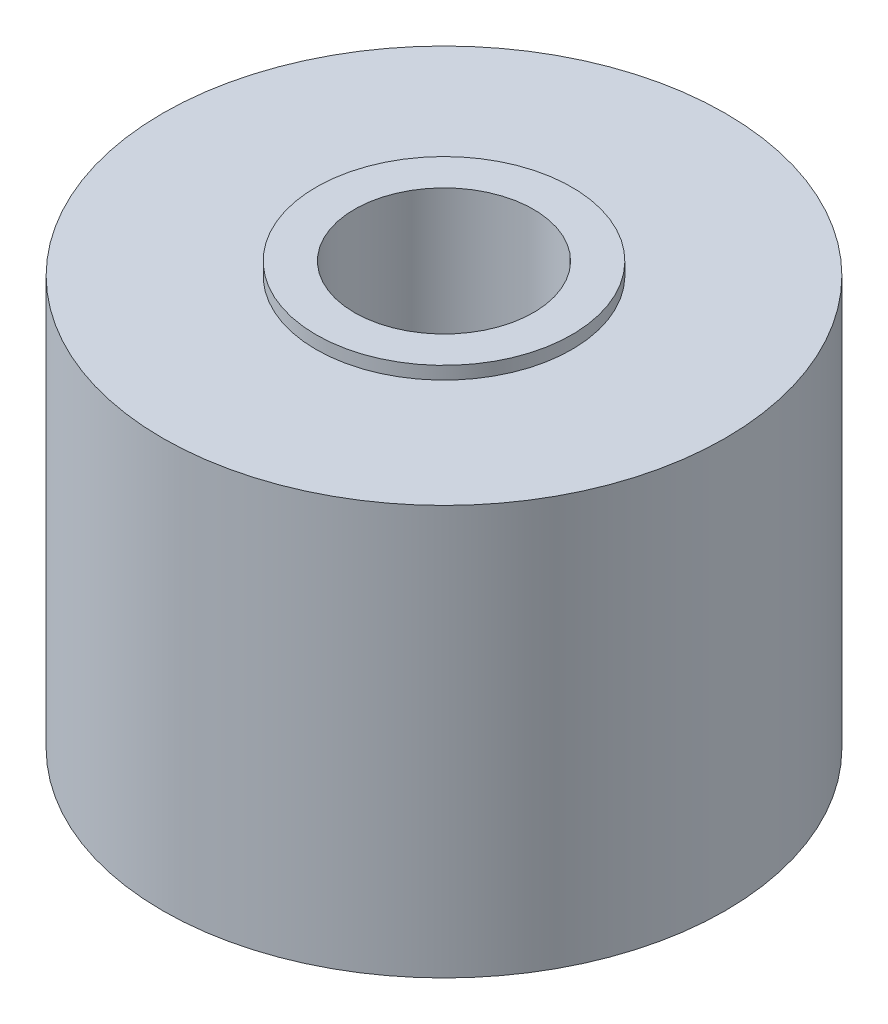
ISO-10303-21;
HEADER;
FILE_DESCRIPTION(('STEP AP214'),'2;1');
FILE_NAME('part.step','',(''),(''),'','','');
FILE_SCHEMA(('AUTOMOTIVE_DESIGN { 1 0 10303 214 1 1 1 1 }'));
ENDSEC;
DATA;
#1=APPLICATION_CONTEXT('core data for automotive mechanical design processes');
#2=APPLICATION_PROTOCOL_DEFINITION('international standard','automotive_design',2000,#1);
#3=PRODUCT_CONTEXT('',#1,'mechanical');
#4=PRODUCT('Part','Part','',(#3));
#5=PRODUCT_RELATED_PRODUCT_CATEGORY('part','',(#4));
#6=PRODUCT_DEFINITION_FORMATION('','',#4);
#7=PRODUCT_DEFINITION_CONTEXT('part definition',#1,'design');
#8=PRODUCT_DEFINITION('design','',#6,#7);
#9=PRODUCT_DEFINITION_SHAPE('','',#8);
#10=(LENGTH_UNIT() NAMED_UNIT(*) SI_UNIT(.MILLI.,.METRE.));
#11=(NAMED_UNIT(*) PLANE_ANGLE_UNIT() SI_UNIT($,.RADIAN.));
#12=(NAMED_UNIT(*) SI_UNIT($,.STERADIAN.) SOLID_ANGLE_UNIT());
#13=UNCERTAINTY_MEASURE_WITH_UNIT(LENGTH_MEASURE(1.E-05),#10,'distance_accuracy_value','');
#14=(GEOMETRIC_REPRESENTATION_CONTEXT(3) GLOBAL_UNCERTAINTY_ASSIGNED_CONTEXT((#13)) GLOBAL_UNIT_ASSIGNED_CONTEXT((#10,
#11,#12)) REPRESENTATION_CONTEXT('',''));
#15=CARTESIAN_POINT('',(0.,0.,0.));
#16=DIRECTION('',(0.,0.,1.));
#17=DIRECTION('',(1.,0.,0.));
#18=AXIS2_PLACEMENT_3D('',#15,#16,#17);
#19=CARTESIAN_POINT('',(0.,16.,0.));
#20=DIRECTION('',(0.,-1.,0.));
#21=DIRECTION('',(0.,0.,-1.));
#22=AXIS2_PLACEMENT_3D('',#19,#20,#21);
#23=CYLINDRICAL_SURFACE('',#22,11.);
#24=CARTESIAN_POINT('',(0.,16.,0.));
#25=DIRECTION('',(0.,1.,0.));
#26=DIRECTION('',(0.,0.,1.));
#27=AXIS2_PLACEMENT_3D('',#24,#25,#26);
#28=CIRCLE('',#27,11.);
#29=CARTESIAN_POINT('',(0.,16.,11.));
#30=VERTEX_POINT('',#29);
#31=EDGE_CURVE('E42',#30,#30,#28,.T.);
#32=ORIENTED_EDGE('',*,*,#31,.F.);
#33=EDGE_LOOP('',(#32));
#34=FACE_BOUND('',#33,.T.);
#35=CARTESIAN_POINT('',(0.,0.,0.));
#36=DIRECTION('',(0.,1.,0.));
#37=DIRECTION('',(0.,0.,1.));
#38=AXIS2_PLACEMENT_3D('',#35,#36,#37);
#39=CIRCLE('',#38,11.);
#40=CARTESIAN_POINT('',(0.,0.,11.));
#41=VERTEX_POINT('',#40);
#42=EDGE_CURVE('E33',#41,#41,#39,.T.);
#43=ORIENTED_EDGE('',*,*,#42,.T.);
#44=EDGE_LOOP('',(#43));
#45=FACE_BOUND('',#44,.T.);
#46=ADVANCED_FACE('F30',(#34,#45),#23,.T.);
#47=CARTESIAN_POINT('',(0.,16.,0.));
#48=DIRECTION('',(0.,1.,0.));
#49=DIRECTION('',(0.,0.,1.));
#50=AXIS2_PLACEMENT_3D('',#47,#48,#49);
#51=PLANE('',#50);
#52=CARTESIAN_POINT('',(0.,16.,0.));
#53=DIRECTION('',(0.,1.,0.));
#54=DIRECTION('',(0.,0.,1.));
#55=AXIS2_PLACEMENT_3D('',#52,#53,#54);
#56=CIRCLE('',#55,5.);
#57=CARTESIAN_POINT('',(0.,16.,5.));
#58=VERTEX_POINT('',#57);
#59=EDGE_CURVE('E37',#58,#58,#56,.T.);
#60=ORIENTED_EDGE('',*,*,#59,.F.);
#61=EDGE_LOOP('',(#60));
#62=FACE_BOUND('',#61,.T.);
#63=ORIENTED_EDGE('',*,*,#31,.T.);
#64=EDGE_LOOP('',(#63));
#65=FACE_BOUND('',#64,.T.);
#66=ADVANCED_FACE('F60',(#62,#65),#51,.T.);
#67=CARTESIAN_POINT('',(0.,0.,0.));
#68=DIRECTION('',(0.,1.,0.));
#69=DIRECTION('',(0.,0.,1.));
#70=AXIS2_PLACEMENT_3D('',#67,#68,#69);
#71=PLANE('',#70);
#72=CARTESIAN_POINT('',(0.,0.,0.));
#73=DIRECTION('',(0.,-1.,0.));
#74=DIRECTION('',(0.,0.,-1.));
#75=AXIS2_PLACEMENT_3D('',#72,#73,#74);
#76=CIRCLE('',#75,9.);
#77=CARTESIAN_POINT('',(0.,0.,-9.));
#78=VERTEX_POINT('',#77);
#79=EDGE_CURVE('E10',#78,#78,#76,.T.);
#80=ORIENTED_EDGE('',*,*,#79,.F.);
#81=EDGE_LOOP('',(#80));
#82=FACE_BOUND('',#81,.T.);
#83=ORIENTED_EDGE('',*,*,#42,.F.);
#84=EDGE_LOOP('',(#83));
#85=FACE_BOUND('',#84,.T.);
#86=ADVANCED_FACE('F57',(#82,#85),#71,.F.);
#87=CARTESIAN_POINT('',(0.,16.5,0.));
#88=DIRECTION('',(0.,-1.,0.));
#89=DIRECTION('',(0.,0.,-1.));
#90=AXIS2_PLACEMENT_3D('',#87,#88,#89);
#91=CYLINDRICAL_SURFACE('',#90,5.);
#92=CARTESIAN_POINT('',(0.,16.5,0.));
#93=DIRECTION('',(0.,1.,0.));
#94=DIRECTION('',(0.,0.,1.));
#95=AXIS2_PLACEMENT_3D('',#92,#93,#94);
#96=CIRCLE('',#95,5.);
#97=CARTESIAN_POINT('',(0.,16.5,5.));
#98=VERTEX_POINT('',#97);
#99=EDGE_CURVE('E48',#98,#98,#96,.T.);
#100=ORIENTED_EDGE('',*,*,#99,.F.);
#101=EDGE_LOOP('',(#100));
#102=FACE_BOUND('',#101,.T.);
#103=ORIENTED_EDGE('',*,*,#59,.T.);
#104=EDGE_LOOP('',(#103));
#105=FACE_BOUND('',#104,.T.);
#106=ADVANCED_FACE('F59',(#102,#105),#91,.T.);
#107=CARTESIAN_POINT('',(0.,16.5,0.));
#108=DIRECTION('',(0.,1.,0.));
#109=DIRECTION('',(0.,0.,1.));
#110=AXIS2_PLACEMENT_3D('',#107,#108,#109);
#111=PLANE('',#110);
#112=CARTESIAN_POINT('',(0.,16.5,0.));
#113=DIRECTION('',(0.,1.,0.));
#114=DIRECTION('',(0.,0.,1.));
#115=AXIS2_PLACEMENT_3D('',#112,#113,#114);
#116=CIRCLE('',#115,3.5);
#117=CARTESIAN_POINT('',(0.,16.5,3.5));
#118=VERTEX_POINT('',#117);
#119=EDGE_CURVE('E138',#118,#118,#116,.T.);
#120=ORIENTED_EDGE('',*,*,#119,.F.);
#121=EDGE_LOOP('',(#120));
#122=FACE_BOUND('',#121,.T.);
#123=ORIENTED_EDGE('',*,*,#99,.T.);
#124=EDGE_LOOP('',(#123));
#125=FACE_BOUND('',#124,.T.);
#126=ADVANCED_FACE('F66',(#122,#125),#111,.T.);
#127=CARTESIAN_POINT('',(0.,-0.5,0.));
#128=DIRECTION('',(0.,1.,0.));
#129=DIRECTION('',(0.,0.,1.));
#130=AXIS2_PLACEMENT_3D('',#127,#128,#129);
#131=CYLINDRICAL_SURFACE('',#130,9.);
#132=CARTESIAN_POINT('',(0.,-0.5,0.));
#133=DIRECTION('',(0.,-1.,0.));
#134=DIRECTION('',(0.,0.,-1.));
#135=AXIS2_PLACEMENT_3D('',#132,#133,#134);
#136=CIRCLE('',#135,9.);
#137=CARTESIAN_POINT('',(0.,-0.5,-9.));
#138=VERTEX_POINT('',#137);
#139=EDGE_CURVE('E46',#138,#138,#136,.T.);
#140=ORIENTED_EDGE('',*,*,#139,.F.);
#141=EDGE_LOOP('',(#140));
#142=FACE_BOUND('',#141,.T.);
#143=ORIENTED_EDGE('',*,*,#79,.T.);
#144=EDGE_LOOP('',(#143));
#145=FACE_BOUND('',#144,.T.);
#146=ADVANCED_FACE('F96',(#142,#145),#131,.T.);
#147=CARTESIAN_POINT('',(0.,-0.5,0.));
#148=DIRECTION('',(0.,-1.,0.));
#149=DIRECTION('',(0.,0.,-1.));
#150=AXIS2_PLACEMENT_3D('',#147,#148,#149);
#151=PLANE('',#150);
#152=CARTESIAN_POINT('',(0.,-0.5,0.));
#153=DIRECTION('',(0.,1.,0.));
#154=DIRECTION('',(0.,0.,1.));
#155=AXIS2_PLACEMENT_3D('',#152,#153,#154);
#156=CIRCLE('',#155,3.5);
#157=CARTESIAN_POINT('',(0.,-0.5,3.5));
#158=VERTEX_POINT('',#157);
#159=EDGE_CURVE('E135',#158,#158,#156,.T.);
#160=ORIENTED_EDGE('',*,*,#159,.T.);
#161=EDGE_LOOP('',(#160));
#162=FACE_BOUND('',#161,.T.);
#163=ORIENTED_EDGE('',*,*,#139,.T.);
#164=EDGE_LOOP('',(#163));
#165=FACE_BOUND('',#164,.T.);
#166=ADVANCED_FACE('F101',(#162,#165),#151,.T.);
#167=CARTESIAN_POINT('',(0.,-0.5,0.));
#168=DIRECTION('',(0.,1.,0.));
#169=DIRECTION('',(0.,0.,1.));
#170=AXIS2_PLACEMENT_3D('',#167,#168,#169);
#171=CYLINDRICAL_SURFACE('',#170,3.5);
#172=ORIENTED_EDGE('',*,*,#159,.F.);
#173=EDGE_LOOP('',(#172));
#174=FACE_BOUND('',#173,.T.);
#175=ORIENTED_EDGE('',*,*,#119,.T.);
#176=EDGE_LOOP('',(#175));
#177=FACE_BOUND('',#176,.T.);
#178=ADVANCED_FACE('F118',(#174,#177),#171,.F.);
#179=CLOSED_SHELL('',(#46,#66,#86,#106,#126,#146,#166,#178));
#180=MANIFOLD_SOLID_BREP('B2',#179);
#181=ADVANCED_BREP_SHAPE_REPRESENTATION('',(#18,#180),#14);
#182=SHAPE_DEFINITION_REPRESENTATION(#9,#181);
ENDSEC;
END-ISO-10303-21;
